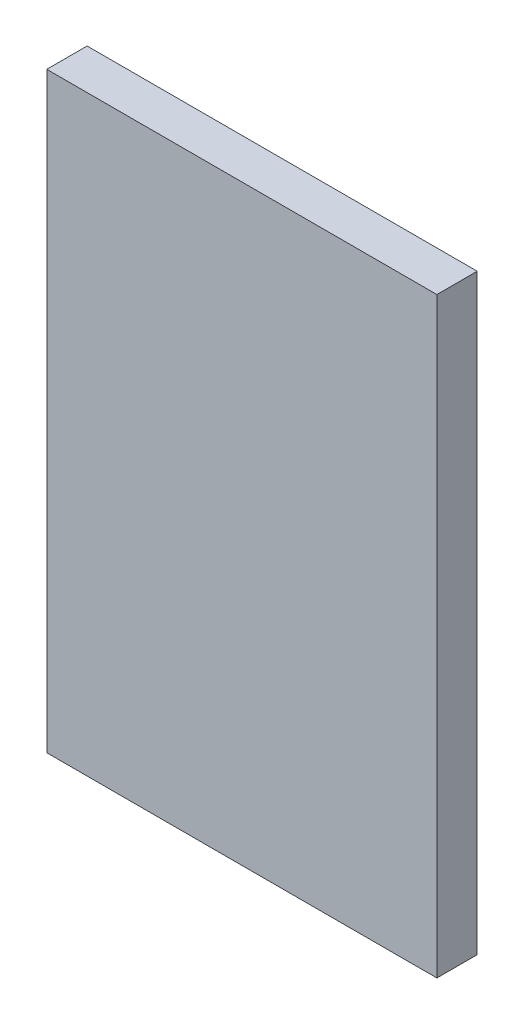
ISO-10303-21;
HEADER;
FILE_DESCRIPTION(('STEP AP214'),'2;1');
FILE_NAME('part.step','',(''),(''),'','','');
FILE_SCHEMA(('AUTOMOTIVE_DESIGN { 1 0 10303 214 1 1 1 1 }'));
ENDSEC;
DATA;
#1=APPLICATION_CONTEXT('core data for automotive mechanical design processes');
#2=APPLICATION_PROTOCOL_DEFINITION('international standard','automotive_design',2000,#1);
#3=PRODUCT_CONTEXT('',#1,'mechanical');
#4=PRODUCT('Part','Part','',(#3));
#5=PRODUCT_RELATED_PRODUCT_CATEGORY('part','',(#4));
#6=PRODUCT_DEFINITION_FORMATION('','',#4);
#7=PRODUCT_DEFINITION_CONTEXT('part definition',#1,'design');
#8=PRODUCT_DEFINITION('design','',#6,#7);
#9=PRODUCT_DEFINITION_SHAPE('','',#8);
#10=(LENGTH_UNIT() NAMED_UNIT(*) SI_UNIT(.MILLI.,.METRE.));
#11=(NAMED_UNIT(*) PLANE_ANGLE_UNIT() SI_UNIT($,.RADIAN.));
#12=(NAMED_UNIT(*) SI_UNIT($,.STERADIAN.) SOLID_ANGLE_UNIT());
#13=UNCERTAINTY_MEASURE_WITH_UNIT(LENGTH_MEASURE(1.E-05),#10,'distance_accuracy_value','');
#14=(GEOMETRIC_REPRESENTATION_CONTEXT(3) GLOBAL_UNCERTAINTY_ASSIGNED_CONTEXT((#13)) GLOBAL_UNIT_ASSIGNED_CONTEXT((#10,
#11,#12)) REPRESENTATION_CONTEXT('',''));
#15=CARTESIAN_POINT('',(0.,0.,0.));
#16=DIRECTION('',(0.,0.,1.));
#17=DIRECTION('',(1.,0.,0.));
#18=AXIS2_PLACEMENT_3D('',#15,#16,#17);
#19=CARTESIAN_POINT('',(92.075,-139.7,19.05));
#20=DIRECTION('',(-1.,0.,0.));
#21=DIRECTION('',(0.,0.,1.));
#22=AXIS2_PLACEMENT_3D('',#19,#20,#21);
#23=PLANE('',#22);
#24=DIRECTION('',(0.,1.,0.));
#25=VECTOR('',#24,1.);
#26=CARTESIAN_POINT('',(92.075,-139.7,0.));
#27=LINE('',#26,#25);
#28=CARTESIAN_POINT('',(92.075,-139.7,0.));
#29=VERTEX_POINT('',#28);
#30=CARTESIAN_POINT('',(92.075,139.7,0.));
#31=VERTEX_POINT('',#30);
#32=EDGE_CURVE('E102',#29,#31,#27,.T.);
#33=ORIENTED_EDGE('',*,*,#32,.T.);
#34=DIRECTION('',(0.,0.,-1.));
#35=VECTOR('',#34,1.);
#36=CARTESIAN_POINT('',(92.075,139.7,19.05));
#37=LINE('',#36,#35);
#38=CARTESIAN_POINT('',(92.075,139.7,19.05));
#39=VERTEX_POINT('',#38);
#40=EDGE_CURVE('E11',#39,#31,#37,.T.);
#41=ORIENTED_EDGE('',*,*,#40,.F.);
#42=DIRECTION('',(0.,1.,0.));
#43=VECTOR('',#42,1.);
#44=CARTESIAN_POINT('',(92.075,-139.7,19.05));
#45=LINE('',#44,#43);
#46=CARTESIAN_POINT('',(92.075,-139.7,19.05));
#47=VERTEX_POINT('',#46);
#48=EDGE_CURVE('E90',#47,#39,#45,.T.);
#49=ORIENTED_EDGE('',*,*,#48,.F.);
#50=DIRECTION('',(0.,0.,-1.));
#51=VECTOR('',#50,1.);
#52=CARTESIAN_POINT('',(92.075,-139.7,19.05));
#53=LINE('',#52,#51);
#54=EDGE_CURVE('E98',#47,#29,#53,.T.);
#55=ORIENTED_EDGE('',*,*,#54,.T.);
#56=EDGE_LOOP('',(#33,#41,#49,#55));
#57=FACE_BOUND('',#56,.T.);
#58=ADVANCED_FACE('F39',(#57),#23,.F.);
#59=CARTESIAN_POINT('',(-92.075,139.7,19.05));
#60=DIRECTION('',(0.,-1.,0.));
#61=DIRECTION('',(0.,0.,-1.));
#62=AXIS2_PLACEMENT_3D('',#59,#60,#61);
#63=PLANE('',#62);
#64=DIRECTION('',(-1.,0.,0.));
#65=VECTOR('',#64,1.);
#66=CARTESIAN_POINT('',(-92.075,139.7,0.));
#67=LINE('',#66,#65);
#68=CARTESIAN_POINT('',(-92.075,139.7,0.));
#69=VERTEX_POINT('',#68);
#70=EDGE_CURVE('E94',#31,#69,#67,.T.);
#71=ORIENTED_EDGE('',*,*,#70,.T.);
#72=DIRECTION('',(0.,0.,-1.));
#73=VECTOR('',#72,1.);
#74=CARTESIAN_POINT('',(-92.075,139.7,19.05));
#75=LINE('',#74,#73);
#76=CARTESIAN_POINT('',(-92.075,139.7,19.05));
#77=VERTEX_POINT('',#76);
#78=EDGE_CURVE('E47',#77,#69,#75,.T.);
#79=ORIENTED_EDGE('',*,*,#78,.F.);
#80=DIRECTION('',(-1.,0.,0.));
#81=VECTOR('',#80,1.);
#82=CARTESIAN_POINT('',(-92.075,139.7,19.05));
#83=LINE('',#82,#81);
#84=EDGE_CURVE('E85',#39,#77,#83,.T.);
#85=ORIENTED_EDGE('',*,*,#84,.F.);
#86=ORIENTED_EDGE('',*,*,#40,.T.);
#87=EDGE_LOOP('',(#71,#79,#85,#86));
#88=FACE_BOUND('',#87,.T.);
#89=ADVANCED_FACE('F93',(#88),#63,.F.);
#90=CARTESIAN_POINT('',(-92.075,-139.7,19.05));
#91=DIRECTION('',(1.,0.,0.));
#92=DIRECTION('',(0.,0.,-1.));
#93=AXIS2_PLACEMENT_3D('',#90,#91,#92);
#94=PLANE('',#93);
#95=DIRECTION('',(0.,-1.,0.));
#96=VECTOR('',#95,1.);
#97=CARTESIAN_POINT('',(-92.075,-139.7,0.));
#98=LINE('',#97,#96);
#99=CARTESIAN_POINT('',(-92.075,-139.7,0.));
#100=VERTEX_POINT('',#99);
#101=EDGE_CURVE('E72',#69,#100,#98,.T.);
#102=ORIENTED_EDGE('',*,*,#101,.T.);
#103=DIRECTION('',(0.,0.,-1.));
#104=VECTOR('',#103,1.);
#105=CARTESIAN_POINT('',(-92.075,-139.7,19.05));
#106=LINE('',#105,#104);
#107=CARTESIAN_POINT('',(-92.075,-139.7,19.05));
#108=VERTEX_POINT('',#107);
#109=EDGE_CURVE('E95',#108,#100,#106,.T.);
#110=ORIENTED_EDGE('',*,*,#109,.F.);
#111=DIRECTION('',(0.,-1.,0.));
#112=VECTOR('',#111,1.);
#113=CARTESIAN_POINT('',(-92.075,-139.7,19.05));
#114=LINE('',#113,#112);
#115=EDGE_CURVE('E88',#77,#108,#114,.T.);
#116=ORIENTED_EDGE('',*,*,#115,.F.);
#117=ORIENTED_EDGE('',*,*,#78,.T.);
#118=EDGE_LOOP('',(#102,#110,#116,#117));
#119=FACE_BOUND('',#118,.T.);
#120=ADVANCED_FACE('F96',(#119),#94,.F.);
#121=CARTESIAN_POINT('',(-92.075,-139.7,19.05));
#122=DIRECTION('',(0.,1.,0.));
#123=DIRECTION('',(0.,0.,1.));
#124=AXIS2_PLACEMENT_3D('',#121,#122,#123);
#125=PLANE('',#124);
#126=DIRECTION('',(1.,0.,0.));
#127=VECTOR('',#126,1.);
#128=CARTESIAN_POINT('',(-92.075,-139.7,0.));
#129=LINE('',#128,#127);
#130=EDGE_CURVE('E78',#100,#29,#129,.T.);
#131=ORIENTED_EDGE('',*,*,#130,.T.);
#132=ORIENTED_EDGE('',*,*,#54,.F.);
#133=DIRECTION('',(1.,0.,0.));
#134=VECTOR('',#133,1.);
#135=CARTESIAN_POINT('',(-92.075,-139.7,19.05));
#136=LINE('',#135,#134);
#137=EDGE_CURVE('E55',#108,#47,#136,.T.);
#138=ORIENTED_EDGE('',*,*,#137,.F.);
#139=ORIENTED_EDGE('',*,*,#109,.T.);
#140=EDGE_LOOP('',(#131,#132,#138,#139));
#141=FACE_BOUND('',#140,.T.);
#142=ADVANCED_FACE('F109',(#141),#125,.F.);
#143=CARTESIAN_POINT('',(0.,0.,19.05));
#144=DIRECTION('',(0.,0.,-1.));
#145=DIRECTION('',(-1.,0.,0.));
#146=AXIS2_PLACEMENT_3D('',#143,#144,#145);
#147=PLANE('',#146);
#148=ORIENTED_EDGE('',*,*,#48,.T.);
#149=ORIENTED_EDGE('',*,*,#84,.T.);
#150=ORIENTED_EDGE('',*,*,#115,.T.);
#151=ORIENTED_EDGE('',*,*,#137,.T.);
#152=EDGE_LOOP('',(#148,#149,#150,#151));
#153=FACE_BOUND('',#152,.T.);
#154=ADVANCED_FACE('F86',(#153),#147,.F.);
#155=CARTESIAN_POINT('',(0.,0.,0.));
#156=DIRECTION('',(0.,0.,-1.));
#157=DIRECTION('',(-1.,0.,0.));
#158=AXIS2_PLACEMENT_3D('',#155,#156,#157);
#159=PLANE('',#158);
#160=ORIENTED_EDGE('',*,*,#32,.F.);
#161=ORIENTED_EDGE('',*,*,#130,.F.);
#162=ORIENTED_EDGE('',*,*,#101,.F.);
#163=ORIENTED_EDGE('',*,*,#70,.F.);
#164=EDGE_LOOP('',(#160,#161,#162,#163));
#165=FACE_BOUND('',#164,.T.);
#166=ADVANCED_FACE('F112',(#165),#159,.T.);
#167=CLOSED_SHELL('',(#58,#89,#120,#142,#154,#166));
#168=MANIFOLD_SOLID_BREP('B2',#167);
#169=ADVANCED_BREP_SHAPE_REPRESENTATION('',(#18,#168),#14);
#170=SHAPE_DEFINITION_REPRESENTATION(#9,#169);
ENDSEC;
END-ISO-10303-21;
